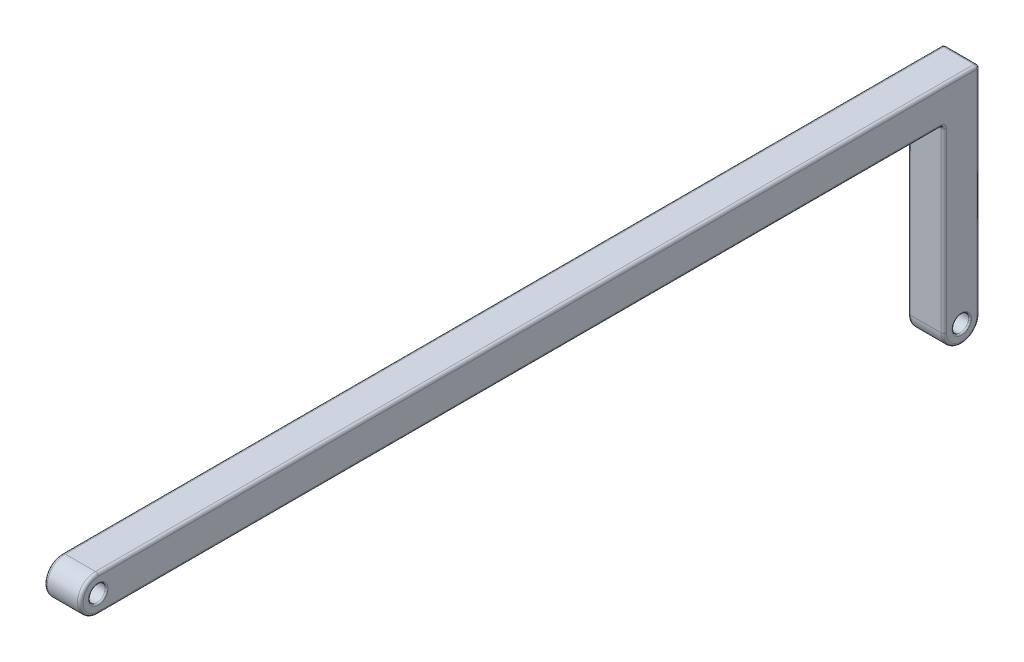
ISO-10303-21;
HEADER;
FILE_DESCRIPTION(('STEP AP214'),'2;1');
FILE_NAME('part.step','',(''),(''),'','','');
FILE_SCHEMA(('AUTOMOTIVE_DESIGN { 1 0 10303 214 1 1 1 1 }'));
ENDSEC;
DATA;
#1=APPLICATION_CONTEXT('core data for automotive mechanical design processes');
#2=APPLICATION_PROTOCOL_DEFINITION('international standard','automotive_design',2000,#1);
#3=PRODUCT_CONTEXT('',#1,'mechanical');
#4=PRODUCT('Part','Part','',(#3));
#5=PRODUCT_RELATED_PRODUCT_CATEGORY('part','',(#4));
#6=PRODUCT_DEFINITION_FORMATION('','',#4);
#7=PRODUCT_DEFINITION_CONTEXT('part definition',#1,'design');
#8=PRODUCT_DEFINITION('design','',#6,#7);
#9=PRODUCT_DEFINITION_SHAPE('','',#8);
#10=(LENGTH_UNIT() NAMED_UNIT(*) SI_UNIT(.MILLI.,.METRE.));
#11=(NAMED_UNIT(*) PLANE_ANGLE_UNIT() SI_UNIT($,.RADIAN.));
#12=(NAMED_UNIT(*) SI_UNIT($,.STERADIAN.) SOLID_ANGLE_UNIT());
#13=UNCERTAINTY_MEASURE_WITH_UNIT(LENGTH_MEASURE(1.E-05),#10,'distance_accuracy_value','');
#14=(GEOMETRIC_REPRESENTATION_CONTEXT(3) GLOBAL_UNCERTAINTY_ASSIGNED_CONTEXT((#13)) GLOBAL_UNIT_ASSIGNED_CONTEXT((#10,
#11,#12)) REPRESENTATION_CONTEXT('',''));
#15=CARTESIAN_POINT('',(0.,0.,0.));
#16=DIRECTION('',(0.,0.,1.));
#17=DIRECTION('',(1.,0.,0.));
#18=AXIS2_PLACEMENT_3D('',#15,#16,#17);
#19=CARTESIAN_POINT('',(2.5,-1.25,0.));
#20=DIRECTION('',(-1.,0.,0.));
#21=DIRECTION('',(0.,0.,1.));
#22=AXIS2_PLACEMENT_3D('',#19,#20,#21);
#23=PLANE('',#22);
#24=DIRECTION('',(0.,0.,1.));
#25=VECTOR('',#24,1.);
#26=CARTESIAN_POINT('',(2.5,-0.2,0.));
#27=LINE('',#26,#25);
#28=CARTESIAN_POINT('',(2.5,-0.2,-61.05));
#29=VERTEX_POINT('',#28);
#30=CARTESIAN_POINT('',(2.5,-0.2,0.));
#31=VERTEX_POINT('',#30);
#32=EDGE_CURVE('E304',#29,#31,#27,.T.);
#33=ORIENTED_EDGE('',*,*,#32,.T.);
#34=CARTESIAN_POINT('',(2.5,-1.25,0.));
#35=DIRECTION('',(-1.,0.,0.));
#36=DIRECTION('',(0.,0.,1.));
#37=AXIS2_PLACEMENT_3D('',#34,#35,#36);
#38=CIRCLE('',#37,1.05);
#39=CARTESIAN_POINT('',(2.5,-2.3,0.));
#40=VERTEX_POINT('',#39);
#41=EDGE_CURVE('E307',#31,#40,#38,.F.);
#42=ORIENTED_EDGE('',*,*,#41,.T.);
#43=DIRECTION('',(0.,0.,-1.));
#44=VECTOR('',#43,1.);
#45=CARTESIAN_POINT('',(2.5,-2.3,0.));
#46=LINE('',#45,#44);
#47=CARTESIAN_POINT('',(2.5,-2.3,-58.55));
#48=VERTEX_POINT('',#47);
#49=EDGE_CURVE('E157',#40,#48,#46,.T.);
#50=ORIENTED_EDGE('',*,*,#49,.T.);
#51=CARTESIAN_POINT('',(2.5,-2.7,-58.55));
#52=DIRECTION('',(-1.,0.,0.));
#53=DIRECTION('',(0.,0.,1.));
#54=AXIS2_PLACEMENT_3D('',#51,#52,#53);
#55=CIRCLE('',#54,0.4);
#56=CARTESIAN_POINT('',(2.5,-2.7,-58.95));
#57=VERTEX_POINT('',#56);
#58=EDGE_CURVE('E151',#57,#48,#55,.F.);
#59=ORIENTED_EDGE('',*,*,#58,.F.);
#60=DIRECTION('',(0.,-1.,0.));
#61=VECTOR('',#60,1.);
#62=CARTESIAN_POINT('',(2.5,-1.25,-58.95));
#63=LINE('',#62,#61);
#64=CARTESIAN_POINT('',(2.5,-15.,-58.95));
#65=VERTEX_POINT('',#64);
#66=EDGE_CURVE('E154',#57,#65,#63,.T.);
#67=ORIENTED_EDGE('',*,*,#66,.T.);
#68=CARTESIAN_POINT('',(2.5,-15.,-60.));
#69=DIRECTION('',(-1.,0.,0.));
#70=DIRECTION('',(0.,0.,1.));
#71=AXIS2_PLACEMENT_3D('',#68,#69,#70);
#72=CIRCLE('',#71,1.05);
#73=CARTESIAN_POINT('',(2.5,-15.,-61.05));
#74=VERTEX_POINT('',#73);
#75=EDGE_CURVE('E173',#65,#74,#72,.F.);
#76=ORIENTED_EDGE('',*,*,#75,.T.);
#77=DIRECTION('',(0.,1.,0.));
#78=VECTOR('',#77,1.);
#79=CARTESIAN_POINT('',(2.5,-1.25,-61.05));
#80=LINE('',#79,#78);
#81=EDGE_CURVE('E162',#74,#29,#80,.T.);
#82=ORIENTED_EDGE('',*,*,#81,.T.);
#83=EDGE_LOOP('',(#33,#42,#50,#59,#67,#76,#82));
#84=FACE_BOUND('',#83,.T.);
#85=CARTESIAN_POINT('',(2.5,-15.,-60.));
#86=DIRECTION('',(-1.,0.,0.));
#87=DIRECTION('',(0.,0.,1.));
#88=AXIS2_PLACEMENT_3D('',#85,#86,#87);
#89=CIRCLE('',#88,0.675000000000001);
#90=CARTESIAN_POINT('',(2.5,-15.,-59.325));
#91=VERTEX_POINT('',#90);
#92=EDGE_CURVE('E287',#91,#91,#89,.T.);
#93=ORIENTED_EDGE('',*,*,#92,.T.);
#94=EDGE_LOOP('',(#93));
#95=FACE_BOUND('',#94,.T.);
#96=CARTESIAN_POINT('',(2.5,-1.25,0.));
#97=DIRECTION('',(-1.,0.,0.));
#98=DIRECTION('',(0.,0.,1.));
#99=AXIS2_PLACEMENT_3D('',#96,#97,#98);
#100=CIRCLE('',#99,0.675);
#101=CARTESIAN_POINT('',(2.5,-1.25,0.675));
#102=VERTEX_POINT('',#101);
#103=EDGE_CURVE('E283',#102,#102,#100,.T.);
#104=ORIENTED_EDGE('',*,*,#103,.T.);
#105=EDGE_LOOP('',(#104));
#106=FACE_BOUND('',#105,.T.);
#107=ADVANCED_FACE('F45',(#84,#95,#106),#23,.F.);
#108=CARTESIAN_POINT('',(0.,-1.25,0.));
#109=DIRECTION('',(-1.,0.,0.));
#110=DIRECTION('',(0.,0.,1.));
#111=AXIS2_PLACEMENT_3D('',#108,#109,#110);
#112=PLANE('',#111);
#113=DIRECTION('',(0.,0.,-1.));
#114=VECTOR('',#113,1.);
#115=CARTESIAN_POINT('',(0.,-2.3,0.));
#116=LINE('',#115,#114);
#117=CARTESIAN_POINT('',(0.,-2.3,-58.55));
#118=VERTEX_POINT('',#117);
#119=CARTESIAN_POINT('',(0.,-2.3,0.));
#120=VERTEX_POINT('',#119);
#121=EDGE_CURVE('E339',#118,#120,#116,.F.);
#122=ORIENTED_EDGE('',*,*,#121,.T.);
#123=CARTESIAN_POINT('',(0.,-1.25,0.));
#124=DIRECTION('',(-1.,0.,0.));
#125=DIRECTION('',(0.,0.,1.));
#126=AXIS2_PLACEMENT_3D('',#123,#124,#125);
#127=CIRCLE('',#126,1.05);
#128=CARTESIAN_POINT('',(0.,-0.2,0.));
#129=VERTEX_POINT('',#128);
#130=EDGE_CURVE('E346',#120,#129,#127,.T.);
#131=ORIENTED_EDGE('',*,*,#130,.T.);
#132=DIRECTION('',(0.,0.,1.));
#133=VECTOR('',#132,1.);
#134=CARTESIAN_POINT('',(0.,-0.2,-61.25));
#135=LINE('',#134,#133);
#136=CARTESIAN_POINT('',(0.,-0.2,-61.05));
#137=VERTEX_POINT('',#136);
#138=EDGE_CURVE('E343',#129,#137,#135,.F.);
#139=ORIENTED_EDGE('',*,*,#138,.T.);
#140=DIRECTION('',(0.,1.,0.));
#141=VECTOR('',#140,1.);
#142=CARTESIAN_POINT('',(0.,-15.,-61.05));
#143=LINE('',#142,#141);
#144=CARTESIAN_POINT('',(0.,-15.,-61.05));
#145=VERTEX_POINT('',#144);
#146=EDGE_CURVE('E336',#137,#145,#143,.F.);
#147=ORIENTED_EDGE('',*,*,#146,.T.);
#148=CARTESIAN_POINT('',(0.,-15.,-60.));
#149=DIRECTION('',(-1.,0.,0.));
#150=DIRECTION('',(0.,0.,1.));
#151=AXIS2_PLACEMENT_3D('',#148,#149,#150);
#152=CIRCLE('',#151,1.05);
#153=CARTESIAN_POINT('',(0.,-15.,-58.95));
#154=VERTEX_POINT('',#153);
#155=EDGE_CURVE('E333',#145,#154,#152,.T.);
#156=ORIENTED_EDGE('',*,*,#155,.T.);
#157=DIRECTION('',(0.,-1.,0.));
#158=VECTOR('',#157,1.);
#159=CARTESIAN_POINT('',(0.,-2.5,-58.95));
#160=LINE('',#159,#158);
#161=CARTESIAN_POINT('',(0.,-2.7,-58.95));
#162=VERTEX_POINT('',#161);
#163=EDGE_CURVE('E330',#154,#162,#160,.F.);
#164=ORIENTED_EDGE('',*,*,#163,.T.);
#165=CARTESIAN_POINT('',(0.,-2.7,-58.55));
#166=DIRECTION('',(-1.,0.,0.));
#167=DIRECTION('',(0.,0.,1.));
#168=AXIS2_PLACEMENT_3D('',#165,#166,#167);
#169=CIRCLE('',#168,0.4);
#170=EDGE_CURVE('E326',#118,#162,#169,.T.);
#171=ORIENTED_EDGE('',*,*,#170,.F.);
#172=EDGE_LOOP('',(#122,#131,#139,#147,#156,#164,#171));
#173=FACE_BOUND('',#172,.T.);
#174=CARTESIAN_POINT('',(0.,-15.,-60.));
#175=DIRECTION('',(-1.,0.,0.));
#176=DIRECTION('',(0.,0.,1.));
#177=AXIS2_PLACEMENT_3D('',#174,#175,#176);
#178=CIRCLE('',#177,0.675000000000001);
#179=CARTESIAN_POINT('',(0.,-15.,-59.325));
#180=VERTEX_POINT('',#179);
#181=EDGE_CURVE('E271',#180,#180,#178,.F.);
#182=ORIENTED_EDGE('',*,*,#181,.T.);
#183=EDGE_LOOP('',(#182));
#184=FACE_BOUND('',#183,.T.);
#185=CARTESIAN_POINT('',(0.,-1.25,0.));
#186=DIRECTION('',(-1.,0.,0.));
#187=DIRECTION('',(0.,0.,1.));
#188=AXIS2_PLACEMENT_3D('',#185,#186,#187);
#189=CIRCLE('',#188,0.675);
#190=CARTESIAN_POINT('',(0.,-1.25,0.675));
#191=VERTEX_POINT('',#190);
#192=EDGE_CURVE('E267',#191,#191,#189,.F.);
#193=ORIENTED_EDGE('',*,*,#192,.T.);
#194=EDGE_LOOP('',(#193));
#195=FACE_BOUND('',#194,.T.);
#196=ADVANCED_FACE('F422',(#173,#184,#195),#112,.T.);
#197=CARTESIAN_POINT('',(2.5,-1.25,0.));
#198=DIRECTION('',(-1.,0.,0.));
#199=DIRECTION('',(0.,0.,1.));
#200=AXIS2_PLACEMENT_3D('',#197,#198,#199);
#201=CYLINDRICAL_SURFACE('',#200,1.25);
#202=DIRECTION('',(-1.,0.,0.));
#203=VECTOR('',#202,1.);
#204=CARTESIAN_POINT('',(2.5,-2.5,0.));
#205=LINE('',#204,#203);
#206=CARTESIAN_POINT('',(2.3,-2.5,0.));
#207=VERTEX_POINT('',#206);
#208=CARTESIAN_POINT('',(0.2,-2.5,0.));
#209=VERTEX_POINT('',#208);
#210=EDGE_CURVE('E263',#207,#209,#205,.T.);
#211=ORIENTED_EDGE('',*,*,#210,.F.);
#212=CARTESIAN_POINT('',(2.3,-1.25,0.));
#213=DIRECTION('',(-1.,0.,0.));
#214=DIRECTION('',(0.,0.,1.));
#215=AXIS2_PLACEMENT_3D('',#212,#213,#214);
#216=CIRCLE('',#215,1.25);
#217=CARTESIAN_POINT('',(2.3,0.,0.));
#218=VERTEX_POINT('',#217);
#219=EDGE_CURVE('E323',#207,#218,#216,.T.);
#220=ORIENTED_EDGE('',*,*,#219,.T.);
#221=DIRECTION('',(-1.,0.,0.));
#222=VECTOR('',#221,1.);
#223=CARTESIAN_POINT('',(2.5,0.,0.));
#224=LINE('',#223,#222);
#225=CARTESIAN_POINT('',(0.2,0.,0.));
#226=VERTEX_POINT('',#225);
#227=EDGE_CURVE('E246',#218,#226,#224,.T.);
#228=ORIENTED_EDGE('',*,*,#227,.T.);
#229=CARTESIAN_POINT('',(0.2,-1.25,0.));
#230=DIRECTION('',(-1.,0.,0.));
#231=DIRECTION('',(0.,0.,1.));
#232=AXIS2_PLACEMENT_3D('',#229,#230,#231);
#233=CIRCLE('',#232,1.25);
#234=EDGE_CURVE('E320',#226,#209,#233,.F.);
#235=ORIENTED_EDGE('',*,*,#234,.T.);
#236=EDGE_LOOP('',(#211,#220,#228,#235));
#237=FACE_BOUND('',#236,.T.);
#238=ADVANCED_FACE('F396',(#237),#201,.T.);
#239=CARTESIAN_POINT('',(2.5,-2.5,0.));
#240=DIRECTION('',(0.,1.,0.));
#241=DIRECTION('',(0.,0.,1.));
#242=AXIS2_PLACEMENT_3D('',#239,#240,#241);
#243=PLANE('',#242);
#244=DIRECTION('',(-1.,0.,0.));
#245=VECTOR('',#244,1.);
#246=CARTESIAN_POINT('',(2.5,-2.5,-58.55));
#247=LINE('',#246,#245);
#248=CARTESIAN_POINT('',(0.2,-2.5,-58.55));
#249=VERTEX_POINT('',#248);
#250=CARTESIAN_POINT('',(2.3,-2.5,-58.55));
#251=VERTEX_POINT('',#250);
#252=EDGE_CURVE('E310',#249,#251,#247,.F.);
#253=ORIENTED_EDGE('',*,*,#252,.T.);
#254=DIRECTION('',(0.,0.,-1.));
#255=VECTOR('',#254,1.);
#256=CARTESIAN_POINT('',(2.3,-2.5,0.));
#257=LINE('',#256,#255);
#258=EDGE_CURVE('E316',#251,#207,#257,.F.);
#259=ORIENTED_EDGE('',*,*,#258,.T.);
#260=ORIENTED_EDGE('',*,*,#210,.T.);
#261=DIRECTION('',(0.,0.,-1.));
#262=VECTOR('',#261,1.);
#263=CARTESIAN_POINT('',(0.2,-2.5,-58.75));
#264=LINE('',#263,#262);
#265=EDGE_CURVE('E313',#209,#249,#264,.T.);
#266=ORIENTED_EDGE('',*,*,#265,.T.);
#267=EDGE_LOOP('',(#253,#259,#260,#266));
#268=FACE_BOUND('',#267,.T.);
#269=ADVANCED_FACE('F393',(#268),#243,.F.);
#270=CARTESIAN_POINT('',(2.5,-15.,-58.75));
#271=DIRECTION('',(0.,0.,-1.));
#272=DIRECTION('',(-1.,0.,0.));
#273=AXIS2_PLACEMENT_3D('',#270,#271,#272);
#274=PLANE('',#273);
#275=DIRECTION('',(-1.,0.,0.));
#276=VECTOR('',#275,1.);
#277=CARTESIAN_POINT('',(2.5,-15.,-58.75));
#278=LINE('',#277,#276);
#279=CARTESIAN_POINT('',(2.3,-15.,-58.75));
#280=VERTEX_POINT('',#279);
#281=CARTESIAN_POINT('',(0.2,-15.,-58.75));
#282=VERTEX_POINT('',#281);
#283=EDGE_CURVE('E257',#280,#282,#278,.T.);
#284=ORIENTED_EDGE('',*,*,#283,.F.);
#285=DIRECTION('',(0.,-1.,0.));
#286=VECTOR('',#285,1.);
#287=CARTESIAN_POINT('',(2.3,-15.,-58.75));
#288=LINE('',#287,#286);
#289=CARTESIAN_POINT('',(2.3,-2.7,-58.75));
#290=VERTEX_POINT('',#289);
#291=EDGE_CURVE('E11',#280,#290,#288,.F.);
#292=ORIENTED_EDGE('',*,*,#291,.T.);
#293=DIRECTION('',(-1.,0.,0.));
#294=VECTOR('',#293,1.);
#295=CARTESIAN_POINT('',(0.,-2.7,-58.75));
#296=LINE('',#295,#294);
#297=CARTESIAN_POINT('',(0.2,-2.7,-58.75));
#298=VERTEX_POINT('',#297);
#299=EDGE_CURVE('E55',#290,#298,#296,.T.);
#300=ORIENTED_EDGE('',*,*,#299,.T.);
#301=DIRECTION('',(0.,-1.,0.));
#302=VECTOR('',#301,1.);
#303=CARTESIAN_POINT('',(0.2,-15.,-58.75));
#304=LINE('',#303,#302);
#305=EDGE_CURVE('E374',#298,#282,#304,.T.);
#306=ORIENTED_EDGE('',*,*,#305,.T.);
#307=EDGE_LOOP('',(#284,#292,#300,#306));
#308=FACE_BOUND('',#307,.T.);
#309=ADVANCED_FACE('F445',(#308),#274,.F.);
#310=CARTESIAN_POINT('',(2.5,-15.,-60.));
#311=DIRECTION('',(-1.,0.,0.));
#312=DIRECTION('',(0.,0.,1.));
#313=AXIS2_PLACEMENT_3D('',#310,#311,#312);
#314=CYLINDRICAL_SURFACE('',#313,1.25);
#315=DIRECTION('',(-1.,0.,0.));
#316=VECTOR('',#315,1.);
#317=CARTESIAN_POINT('',(2.5,-15.,-61.25));
#318=LINE('',#317,#316);
#319=CARTESIAN_POINT('',(2.3,-15.,-61.25));
#320=VERTEX_POINT('',#319);
#321=CARTESIAN_POINT('',(0.2,-15.,-61.25));
#322=VERTEX_POINT('',#321);
#323=EDGE_CURVE('E250',#320,#322,#318,.T.);
#324=ORIENTED_EDGE('',*,*,#323,.F.);
#325=CARTESIAN_POINT('',(2.3,-15.,-60.));
#326=DIRECTION('',(-1.,0.,0.));
#327=DIRECTION('',(0.,0.,1.));
#328=AXIS2_PLACEMENT_3D('',#325,#326,#327);
#329=CIRCLE('',#328,1.25);
#330=EDGE_CURVE('E362',#320,#280,#329,.T.);
#331=ORIENTED_EDGE('',*,*,#330,.T.);
#332=ORIENTED_EDGE('',*,*,#283,.T.);
#333=CARTESIAN_POINT('',(0.2,-15.,-60.));
#334=DIRECTION('',(-1.,0.,0.));
#335=DIRECTION('',(0.,0.,1.));
#336=AXIS2_PLACEMENT_3D('',#333,#334,#335);
#337=CIRCLE('',#336,1.25);
#338=EDGE_CURVE('E359',#282,#322,#337,.F.);
#339=ORIENTED_EDGE('',*,*,#338,.T.);
#340=EDGE_LOOP('',(#324,#331,#332,#339));
#341=FACE_BOUND('',#340,.T.);
#342=ADVANCED_FACE('F441',(#341),#314,.T.);
#343=CARTESIAN_POINT('',(2.5,0.,-61.25));
#344=DIRECTION('',(0.,0.,1.));
#345=DIRECTION('',(1.,0.,0.));
#346=AXIS2_PLACEMENT_3D('',#343,#344,#345);
#347=PLANE('',#346);
#348=DIRECTION('',(-1.,0.,0.));
#349=VECTOR('',#348,1.);
#350=CARTESIAN_POINT('',(2.5,-0.2,-61.25));
#351=LINE('',#350,#349);
#352=CARTESIAN_POINT('',(0.2,-0.2,-61.25));
#353=VERTEX_POINT('',#352);
#354=CARTESIAN_POINT('',(2.3,-0.2,-61.25));
#355=VERTEX_POINT('',#354);
#356=EDGE_CURVE('E349',#353,#355,#351,.F.);
#357=ORIENTED_EDGE('',*,*,#356,.T.);
#358=DIRECTION('',(0.,1.,0.));
#359=VECTOR('',#358,1.);
#360=CARTESIAN_POINT('',(2.3,0.,-61.25));
#361=LINE('',#360,#359);
#362=EDGE_CURVE('E355',#355,#320,#361,.F.);
#363=ORIENTED_EDGE('',*,*,#362,.T.);
#364=ORIENTED_EDGE('',*,*,#323,.T.);
#365=DIRECTION('',(0.,1.,0.));
#366=VECTOR('',#365,1.);
#367=CARTESIAN_POINT('',(0.2,0.,-61.25));
#368=LINE('',#367,#366);
#369=EDGE_CURVE('E352',#322,#353,#368,.T.);
#370=ORIENTED_EDGE('',*,*,#369,.T.);
#371=EDGE_LOOP('',(#357,#363,#364,#370));
#372=FACE_BOUND('',#371,.T.);
#373=ADVANCED_FACE('F437',(#372),#347,.F.);
#374=CARTESIAN_POINT('',(2.5,0.,0.));
#375=DIRECTION('',(0.,-1.,0.));
#376=DIRECTION('',(0.,0.,-1.));
#377=AXIS2_PLACEMENT_3D('',#374,#375,#376);
#378=PLANE('',#377);
#379=ORIENTED_EDGE('',*,*,#227,.F.);
#380=DIRECTION('',(0.,0.,1.));
#381=VECTOR('',#380,1.);
#382=CARTESIAN_POINT('',(2.3,0.,0.));
#383=LINE('',#382,#381);
#384=CARTESIAN_POINT('',(2.3,0.,-61.05));
#385=VERTEX_POINT('',#384);
#386=EDGE_CURVE('E371',#218,#385,#383,.F.);
#387=ORIENTED_EDGE('',*,*,#386,.T.);
#388=DIRECTION('',(-1.,0.,0.));
#389=VECTOR('',#388,1.);
#390=CARTESIAN_POINT('',(2.5,0.,-61.05));
#391=LINE('',#390,#389);
#392=CARTESIAN_POINT('',(0.2,0.,-61.05));
#393=VERTEX_POINT('',#392);
#394=EDGE_CURVE('E368',#385,#393,#391,.T.);
#395=ORIENTED_EDGE('',*,*,#394,.T.);
#396=DIRECTION('',(0.,0.,1.));
#397=VECTOR('',#396,1.);
#398=CARTESIAN_POINT('',(0.2,0.,0.));
#399=LINE('',#398,#397);
#400=EDGE_CURVE('E365',#393,#226,#399,.T.);
#401=ORIENTED_EDGE('',*,*,#400,.T.);
#402=EDGE_LOOP('',(#379,#387,#395,#401));
#403=FACE_BOUND('',#402,.T.);
#404=ADVANCED_FACE('F434',(#403),#378,.F.);
#405=CARTESIAN_POINT('',(2.5,-1.25,0.));
#406=DIRECTION('',(-1.,0.,0.));
#407=DIRECTION('',(0.,0.,1.));
#408=AXIS2_PLACEMENT_3D('',#405,#406,#407);
#409=CYLINDRICAL_SURFACE('',#408,0.575);
#410=CARTESIAN_POINT('',(0.0999999999999998,-1.25,0.));
#411=DIRECTION('',(-1.,0.,0.));
#412=DIRECTION('',(0.,0.,1.));
#413=AXIS2_PLACEMENT_3D('',#410,#411,#412);
#414=CIRCLE('',#413,0.575);
#415=CARTESIAN_POINT('',(0.0999999999999998,-1.25,0.575));
#416=VERTEX_POINT('',#415);
#417=EDGE_CURVE('E174',#416,#416,#414,.T.);
#418=ORIENTED_EDGE('',*,*,#417,.T.);
#419=EDGE_LOOP('',(#418));
#420=FACE_BOUND('',#419,.T.);
#421=CARTESIAN_POINT('',(2.4,-1.25,0.));
#422=DIRECTION('',(-1.,0.,0.));
#423=DIRECTION('',(0.,0.,1.));
#424=AXIS2_PLACEMENT_3D('',#421,#422,#423);
#425=CIRCLE('',#424,0.575);
#426=CARTESIAN_POINT('',(2.4,-1.25,0.575));
#427=VERTEX_POINT('',#426);
#428=EDGE_CURVE('E291',#427,#427,#425,.F.);
#429=ORIENTED_EDGE('',*,*,#428,.T.);
#430=EDGE_LOOP('',(#429));
#431=FACE_BOUND('',#430,.T.);
#432=ADVANCED_FACE('F431',(#420,#431),#409,.F.);
#433=CARTESIAN_POINT('',(2.5,-15.,-60.));
#434=DIRECTION('',(-1.,0.,0.));
#435=DIRECTION('',(0.,0.,1.));
#436=AXIS2_PLACEMENT_3D('',#433,#434,#435);
#437=CYLINDRICAL_SURFACE('',#436,0.575000000000001);
#438=CARTESIAN_POINT('',(0.0999999999999998,-15.,-60.));
#439=DIRECTION('',(-1.,0.,0.));
#440=DIRECTION('',(0.,0.,1.));
#441=AXIS2_PLACEMENT_3D('',#438,#439,#440);
#442=CIRCLE('',#441,0.575000000000001);
#443=CARTESIAN_POINT('',(0.0999999999999998,-15.,-59.425));
#444=VERTEX_POINT('',#443);
#445=EDGE_CURVE('E279',#444,#444,#442,.T.);
#446=ORIENTED_EDGE('',*,*,#445,.T.);
#447=EDGE_LOOP('',(#446));
#448=FACE_BOUND('',#447,.T.);
#449=CARTESIAN_POINT('',(2.4,-15.,-60.));
#450=DIRECTION('',(-1.,0.,0.));
#451=DIRECTION('',(0.,0.,1.));
#452=AXIS2_PLACEMENT_3D('',#449,#450,#451);
#453=CIRCLE('',#452,0.575000000000001);
#454=CARTESIAN_POINT('',(2.4,-15.,-59.425));
#455=VERTEX_POINT('',#454);
#456=EDGE_CURVE('E275',#455,#455,#453,.F.);
#457=ORIENTED_EDGE('',*,*,#456,.T.);
#458=EDGE_LOOP('',(#457));
#459=FACE_BOUND('',#458,.T.);
#460=ADVANCED_FACE('F457',(#448,#459),#437,.F.);
#461=CARTESIAN_POINT('',(0.0999999999999998,-15.,-60.));
#462=DIRECTION('',(-1.,0.,0.));
#463=DIRECTION('',(0.,0.,1.));
#464=AXIS2_PLACEMENT_3D('',#461,#462,#463);
#465=TOROIDAL_SURFACE('',#464,0.675000000000001,0.1);
#466=ORIENTED_EDGE('',*,*,#445,.F.);
#467=EDGE_LOOP('',(#466));
#468=FACE_BOUND('',#467,.T.);
#469=ORIENTED_EDGE('',*,*,#181,.F.);
#470=EDGE_LOOP('',(#469));
#471=FACE_BOUND('',#470,.T.);
#472=ADVANCED_FACE('F453',(#468,#471),#465,.T.);
#473=CARTESIAN_POINT('',(2.4,-15.,-60.));
#474=DIRECTION('',(-1.,0.,0.));
#475=DIRECTION('',(0.,0.,1.));
#476=AXIS2_PLACEMENT_3D('',#473,#474,#475);
#477=TOROIDAL_SURFACE('',#476,0.675000000000001,0.1);
#478=ORIENTED_EDGE('',*,*,#92,.F.);
#479=EDGE_LOOP('',(#478));
#480=FACE_BOUND('',#479,.T.);
#481=ORIENTED_EDGE('',*,*,#456,.F.);
#482=EDGE_LOOP('',(#481));
#483=FACE_BOUND('',#482,.T.);
#484=ADVANCED_FACE('F456',(#480,#483),#477,.T.);
#485=CARTESIAN_POINT('',(0.0999999999999998,-1.25,0.));
#486=DIRECTION('',(-1.,0.,0.));
#487=DIRECTION('',(0.,0.,1.));
#488=AXIS2_PLACEMENT_3D('',#485,#486,#487);
#489=TOROIDAL_SURFACE('',#488,0.675,0.1);
#490=ORIENTED_EDGE('',*,*,#417,.F.);
#491=EDGE_LOOP('',(#490));
#492=FACE_BOUND('',#491,.T.);
#493=ORIENTED_EDGE('',*,*,#192,.F.);
#494=EDGE_LOOP('',(#493));
#495=FACE_BOUND('',#494,.T.);
#496=ADVANCED_FACE('F461',(#492,#495),#489,.T.);
#497=CARTESIAN_POINT('',(2.4,-1.25,0.));
#498=DIRECTION('',(-1.,0.,0.));
#499=DIRECTION('',(0.,0.,1.));
#500=AXIS2_PLACEMENT_3D('',#497,#498,#499);
#501=TOROIDAL_SURFACE('',#500,0.675,0.1);
#502=ORIENTED_EDGE('',*,*,#103,.F.);
#503=EDGE_LOOP('',(#502));
#504=FACE_BOUND('',#503,.T.);
#505=ORIENTED_EDGE('',*,*,#428,.F.);
#506=EDGE_LOOP('',(#505));
#507=FACE_BOUND('',#506,.T.);
#508=ADVANCED_FACE('F465',(#504,#507),#501,.T.);
#509=CARTESIAN_POINT('',(0.2,0.,-61.05));
#510=DIRECTION('',(0.,-1.,0.));
#511=DIRECTION('',(0.,0.,-1.));
#512=AXIS2_PLACEMENT_3D('',#509,#510,#511);
#513=CYLINDRICAL_SURFACE('',#512,0.2);
#514=CARTESIAN_POINT('',(0.2,-15.,-61.05));
#515=DIRECTION('',(0.,-1.,0.));
#516=DIRECTION('',(0.,0.,-1.));
#517=AXIS2_PLACEMENT_3D('',#514,#515,#516);
#518=CIRCLE('',#517,0.2);
#519=EDGE_CURVE('E235',#145,#322,#518,.T.);
#520=ORIENTED_EDGE('',*,*,#519,.F.);
#521=ORIENTED_EDGE('',*,*,#146,.F.);
#522=CARTESIAN_POINT('',(0.2,-0.2,-61.05));
#523=DIRECTION('',(0.,1.,0.));
#524=DIRECTION('',(0.,0.,1.));
#525=AXIS2_PLACEMENT_3D('',#522,#523,#524);
#526=CIRCLE('',#525,0.2);
#527=EDGE_CURVE('E238',#353,#137,#526,.T.);
#528=ORIENTED_EDGE('',*,*,#527,.F.);
#529=ORIENTED_EDGE('',*,*,#369,.F.);
#530=EDGE_LOOP('',(#520,#521,#528,#529));
#531=FACE_BOUND('',#530,.T.);
#532=ADVANCED_FACE('F47',(#531),#513,.T.);
#533=CARTESIAN_POINT('',(0.2,-0.2,0.));
#534=DIRECTION('',(0.,0.,-1.));
#535=DIRECTION('',(-1.,0.,0.));
#536=AXIS2_PLACEMENT_3D('',#533,#534,#535);
#537=CYLINDRICAL_SURFACE('',#536,0.2);
#538=CARTESIAN_POINT('',(0.2,-0.2,-61.05));
#539=DIRECTION('',(0.,0.,-1.));
#540=DIRECTION('',(-1.,0.,0.));
#541=AXIS2_PLACEMENT_3D('',#538,#539,#540);
#542=CIRCLE('',#541,0.2);
#543=EDGE_CURVE('E49',#137,#393,#542,.T.);
#544=ORIENTED_EDGE('',*,*,#543,.F.);
#545=ORIENTED_EDGE('',*,*,#138,.F.);
#546=CARTESIAN_POINT('',(0.2,-0.2,0.));
#547=DIRECTION('',(0.,0.,1.));
#548=DIRECTION('',(1.,0.,0.));
#549=AXIS2_PLACEMENT_3D('',#546,#547,#548);
#550=CIRCLE('',#549,0.2);
#551=EDGE_CURVE('E231',#226,#129,#550,.T.);
#552=ORIENTED_EDGE('',*,*,#551,.F.);
#553=ORIENTED_EDGE('',*,*,#400,.F.);
#554=EDGE_LOOP('',(#544,#545,#552,#553));
#555=FACE_BOUND('',#554,.T.);
#556=ADVANCED_FACE('F588',(#555),#537,.T.);
#557=CARTESIAN_POINT('',(0.2,-0.2,-61.05));
#558=DIRECTION('',(-1.,0.,0.));
#559=DIRECTION('',(0.,0.,1.));
#560=AXIS2_PLACEMENT_3D('',#557,#558,#559);
#561=SPHERICAL_SURFACE('',#560,0.2);
#562=ORIENTED_EDGE('',*,*,#527,.T.);
#563=ORIENTED_EDGE('',*,*,#543,.T.);
#564=CARTESIAN_POINT('',(0.2,-0.2,-61.05));
#565=DIRECTION('',(-1.,0.,0.));
#566=DIRECTION('',(0.,0.,1.));
#567=AXIS2_PLACEMENT_3D('',#564,#565,#566);
#568=CIRCLE('',#567,0.2);
#569=EDGE_CURVE('E227',#353,#393,#568,.F.);
#570=ORIENTED_EDGE('',*,*,#569,.F.);
#571=EDGE_LOOP('',(#562,#563,#570));
#572=FACE_BOUND('',#571,.T.);
#573=ADVANCED_FACE('F579',(#572),#561,.T.);
#574=CARTESIAN_POINT('',(0.2,-15.,-60.));
#575=DIRECTION('',(-1.,0.,0.));
#576=DIRECTION('',(0.,0.,1.));
#577=AXIS2_PLACEMENT_3D('',#574,#575,#576);
#578=TOROIDAL_SURFACE('',#577,1.05,0.2);
#579=ORIENTED_EDGE('',*,*,#519,.T.);
#580=ORIENTED_EDGE('',*,*,#338,.F.);
#581=CARTESIAN_POINT('',(0.2,-15.,-58.95));
#582=DIRECTION('',(0.,1.,0.));
#583=DIRECTION('',(0.,0.,1.));
#584=AXIS2_PLACEMENT_3D('',#581,#582,#583);
#585=CIRCLE('',#584,0.2);
#586=EDGE_CURVE('E223',#154,#282,#585,.T.);
#587=ORIENTED_EDGE('',*,*,#586,.F.);
#588=ORIENTED_EDGE('',*,*,#155,.F.);
#589=EDGE_LOOP('',(#579,#580,#587,#588));
#590=FACE_BOUND('',#589,.T.);
#591=ADVANCED_FACE('F571',(#590),#578,.T.);
#592=CARTESIAN_POINT('',(0.2,-1.25,0.));
#593=DIRECTION('',(-1.,0.,0.));
#594=DIRECTION('',(0.,0.,1.));
#595=AXIS2_PLACEMENT_3D('',#592,#593,#594);
#596=TOROIDAL_SURFACE('',#595,1.05,0.2);
#597=ORIENTED_EDGE('',*,*,#551,.T.);
#598=ORIENTED_EDGE('',*,*,#130,.F.);
#599=CARTESIAN_POINT('',(0.2,-2.3,0.));
#600=DIRECTION('',(0.,0.,-1.));
#601=DIRECTION('',(-1.,0.,0.));
#602=AXIS2_PLACEMENT_3D('',#599,#600,#601);
#603=CIRCLE('',#602,0.2);
#604=EDGE_CURVE('E220',#209,#120,#603,.T.);
#605=ORIENTED_EDGE('',*,*,#604,.F.);
#606=ORIENTED_EDGE('',*,*,#234,.F.);
#607=EDGE_LOOP('',(#597,#598,#605,#606));
#608=FACE_BOUND('',#607,.T.);
#609=ADVANCED_FACE('F399',(#608),#596,.T.);
#610=CARTESIAN_POINT('',(2.5,-0.2,-61.05));
#611=DIRECTION('',(-1.,0.,0.));
#612=DIRECTION('',(0.,0.,1.));
#613=AXIS2_PLACEMENT_3D('',#610,#611,#612);
#614=CYLINDRICAL_SURFACE('',#613,0.2);
#615=ORIENTED_EDGE('',*,*,#569,.T.);
#616=ORIENTED_EDGE('',*,*,#394,.F.);
#617=CARTESIAN_POINT('',(2.3,-0.2,-61.05));
#618=DIRECTION('',(1.,0.,0.));
#619=DIRECTION('',(0.,0.,-1.));
#620=AXIS2_PLACEMENT_3D('',#617,#618,#619);
#621=CIRCLE('',#620,0.2);
#622=EDGE_CURVE('E216',#355,#385,#621,.T.);
#623=ORIENTED_EDGE('',*,*,#622,.F.);
#624=ORIENTED_EDGE('',*,*,#356,.F.);
#625=EDGE_LOOP('',(#615,#616,#623,#624));
#626=FACE_BOUND('',#625,.T.);
#627=ADVANCED_FACE('F554',(#626),#614,.T.);
#628=CARTESIAN_POINT('',(2.3,-1.25,-61.05));
#629=DIRECTION('',(0.,1.,0.));
#630=DIRECTION('',(0.,0.,1.));
#631=AXIS2_PLACEMENT_3D('',#628,#629,#630);
#632=CYLINDRICAL_SURFACE('',#631,0.2);
#633=CARTESIAN_POINT('',(2.3,-15.,-61.05));
#634=DIRECTION('',(0.,-1.,0.));
#635=DIRECTION('',(0.,0.,-1.));
#636=AXIS2_PLACEMENT_3D('',#633,#634,#635);
#637=CIRCLE('',#636,0.2);
#638=EDGE_CURVE('E208',#320,#74,#637,.T.);
#639=ORIENTED_EDGE('',*,*,#638,.F.);
#640=ORIENTED_EDGE('',*,*,#362,.F.);
#641=CARTESIAN_POINT('',(2.3,-0.2,-61.05));
#642=DIRECTION('',(0.,1.,0.));
#643=DIRECTION('',(0.,0.,1.));
#644=AXIS2_PLACEMENT_3D('',#641,#642,#643);
#645=CIRCLE('',#644,0.2);
#646=EDGE_CURVE('E212',#29,#355,#645,.T.);
#647=ORIENTED_EDGE('',*,*,#646,.F.);
#648=ORIENTED_EDGE('',*,*,#81,.F.);
#649=EDGE_LOOP('',(#639,#640,#647,#648));
#650=FACE_BOUND('',#649,.T.);
#651=ADVANCED_FACE('F545',(#650),#632,.T.);
#652=CARTESIAN_POINT('',(0.2,-15.,-58.95));
#653=DIRECTION('',(0.,1.,0.));
#654=DIRECTION('',(0.,0.,1.));
#655=AXIS2_PLACEMENT_3D('',#652,#653,#654);
#656=CYLINDRICAL_SURFACE('',#655,0.2);
#657=ORIENTED_EDGE('',*,*,#586,.T.);
#658=ORIENTED_EDGE('',*,*,#305,.F.);
#659=CARTESIAN_POINT('',(0.2,-2.7,-58.95));
#660=DIRECTION('',(0.,1.,0.));
#661=DIRECTION('',(0.,0.,1.));
#662=AXIS2_PLACEMENT_3D('',#659,#660,#661);
#663=CIRCLE('',#662,0.2);
#664=EDGE_CURVE('E204',#162,#298,#663,.T.);
#665=ORIENTED_EDGE('',*,*,#664,.F.);
#666=ORIENTED_EDGE('',*,*,#163,.F.);
#667=EDGE_LOOP('',(#657,#658,#665,#666));
#668=FACE_BOUND('',#667,.T.);
#669=ADVANCED_FACE('F537',(#668),#656,.T.);
#670=CARTESIAN_POINT('',(0.2,-2.3,0.));
#671=DIRECTION('',(0.,0.,1.));
#672=DIRECTION('',(0.,-1.,0.));
#673=AXIS2_PLACEMENT_3D('',#670,#671,#672);
#674=CYLINDRICAL_SURFACE('',#673,0.2);
#675=ORIENTED_EDGE('',*,*,#604,.T.);
#676=ORIENTED_EDGE('',*,*,#121,.F.);
#677=CARTESIAN_POINT('',(0.2,-2.3,-58.55));
#678=DIRECTION('',(0.,0.,-1.));
#679=DIRECTION('',(-1.,0.,0.));
#680=AXIS2_PLACEMENT_3D('',#677,#678,#679);
#681=CIRCLE('',#680,0.2);
#682=EDGE_CURVE('E200',#249,#118,#681,.T.);
#683=ORIENTED_EDGE('',*,*,#682,.F.);
#684=ORIENTED_EDGE('',*,*,#265,.F.);
#685=EDGE_LOOP('',(#675,#676,#683,#684));
#686=FACE_BOUND('',#685,.T.);
#687=ADVANCED_FACE('F405',(#686),#674,.T.);
#688=CARTESIAN_POINT('',(2.3,-0.2,-61.05));
#689=DIRECTION('',(0.,0.,-1.));
#690=DIRECTION('',(-1.,0.,0.));
#691=AXIS2_PLACEMENT_3D('',#688,#689,#690);
#692=SPHERICAL_SURFACE('',#691,0.2);
#693=ORIENTED_EDGE('',*,*,#646,.T.);
#694=ORIENTED_EDGE('',*,*,#622,.T.);
#695=CARTESIAN_POINT('',(2.3,-0.2,-61.05));
#696=DIRECTION('',(0.,0.,-1.));
#697=DIRECTION('',(-1.,0.,0.));
#698=AXIS2_PLACEMENT_3D('',#695,#696,#697);
#699=CIRCLE('',#698,0.2);
#700=EDGE_CURVE('E196',#29,#385,#699,.F.);
#701=ORIENTED_EDGE('',*,*,#700,.F.);
#702=EDGE_LOOP('',(#693,#694,#701));
#703=FACE_BOUND('',#702,.T.);
#704=ADVANCED_FACE('F520',(#703),#692,.T.);
#705=CARTESIAN_POINT('',(2.3,-15.,-60.));
#706=DIRECTION('',(-1.,0.,0.));
#707=DIRECTION('',(0.,0.,1.));
#708=AXIS2_PLACEMENT_3D('',#705,#706,#707);
#709=TOROIDAL_SURFACE('',#708,1.05,0.2);
#710=ORIENTED_EDGE('',*,*,#638,.T.);
#711=ORIENTED_EDGE('',*,*,#75,.F.);
#712=CARTESIAN_POINT('',(2.3,-15.,-58.95));
#713=DIRECTION('',(0.,1.,0.));
#714=DIRECTION('',(0.,0.,1.));
#715=AXIS2_PLACEMENT_3D('',#712,#713,#714);
#716=CIRCLE('',#715,0.2);
#717=EDGE_CURVE('E171',#280,#65,#716,.T.);
#718=ORIENTED_EDGE('',*,*,#717,.F.);
#719=ORIENTED_EDGE('',*,*,#330,.F.);
#720=EDGE_LOOP('',(#710,#711,#718,#719));
#721=FACE_BOUND('',#720,.T.);
#722=ADVANCED_FACE('F512',(#721),#709,.T.);
#723=CARTESIAN_POINT('',(0.2,-2.7,-58.55));
#724=DIRECTION('',(-1.,0.,0.));
#725=DIRECTION('',(0.,0.,1.));
#726=AXIS2_PLACEMENT_3D('',#723,#724,#725);
#727=TOROIDAL_SURFACE('',#726,0.4,0.2);
#728=ORIENTED_EDGE('',*,*,#170,.T.);
#729=ORIENTED_EDGE('',*,*,#664,.T.);
#730=CARTESIAN_POINT('',(0.2,-2.7,-58.55));
#731=DIRECTION('',(-1.,0.,0.));
#732=DIRECTION('',(0.,0.,1.));
#733=AXIS2_PLACEMENT_3D('',#730,#731,#732);
#734=CIRCLE('',#733,0.2);
#735=EDGE_CURVE('E185',#249,#298,#734,.T.);
#736=ORIENTED_EDGE('',*,*,#735,.F.);
#737=ORIENTED_EDGE('',*,*,#682,.T.);
#738=EDGE_LOOP('',(#728,#729,#736,#737));
#739=FACE_BOUND('',#738,.T.);
#740=ADVANCED_FACE('F408',(#739),#727,.T.);
#741=CARTESIAN_POINT('',(2.3,-0.2,0.));
#742=DIRECTION('',(0.,0.,1.));
#743=DIRECTION('',(1.,0.,0.));
#744=AXIS2_PLACEMENT_3D('',#741,#742,#743);
#745=CYLINDRICAL_SURFACE('',#744,0.2);
#746=ORIENTED_EDGE('',*,*,#700,.T.);
#747=ORIENTED_EDGE('',*,*,#386,.F.);
#748=CARTESIAN_POINT('',(2.3,-0.2,0.));
#749=DIRECTION('',(0.,0.,1.));
#750=DIRECTION('',(0.,-1.,0.));
#751=AXIS2_PLACEMENT_3D('',#748,#749,#750);
#752=CIRCLE('',#751,0.2);
#753=EDGE_CURVE('E180',#31,#218,#752,.T.);
#754=ORIENTED_EDGE('',*,*,#753,.F.);
#755=ORIENTED_EDGE('',*,*,#32,.F.);
#756=EDGE_LOOP('',(#746,#747,#754,#755));
#757=FACE_BOUND('',#756,.T.);
#758=ADVANCED_FACE('F419',(#757),#745,.T.);
#759=CARTESIAN_POINT('',(2.3,-1.25,-58.95));
#760=DIRECTION('',(0.,-1.,0.));
#761=DIRECTION('',(0.,0.,-1.));
#762=AXIS2_PLACEMENT_3D('',#759,#760,#761);
#763=CYLINDRICAL_SURFACE('',#762,0.2);
#764=ORIENTED_EDGE('',*,*,#717,.T.);
#765=ORIENTED_EDGE('',*,*,#66,.F.);
#766=CARTESIAN_POINT('',(2.3,-2.7,-58.95));
#767=DIRECTION('',(0.,1.,0.));
#768=DIRECTION('',(0.,0.,1.));
#769=AXIS2_PLACEMENT_3D('',#766,#767,#768);
#770=CIRCLE('',#769,0.2);
#771=EDGE_CURVE('E168',#290,#57,#770,.T.);
#772=ORIENTED_EDGE('',*,*,#771,.F.);
#773=ORIENTED_EDGE('',*,*,#291,.F.);
#774=EDGE_LOOP('',(#764,#765,#772,#773));
#775=FACE_BOUND('',#774,.T.);
#776=ADVANCED_FACE('F167',(#775),#763,.T.);
#777=CARTESIAN_POINT('',(2.5,-2.7,-58.55));
#778=DIRECTION('',(1.,0.,0.));
#779=DIRECTION('',(0.,0.,-1.));
#780=AXIS2_PLACEMENT_3D('',#777,#778,#779);
#781=CYLINDRICAL_SURFACE('',#780,0.2);
#782=ORIENTED_EDGE('',*,*,#735,.T.);
#783=ORIENTED_EDGE('',*,*,#299,.F.);
#784=CARTESIAN_POINT('',(2.3,-2.7,-58.55));
#785=DIRECTION('',(-1.,0.,0.));
#786=DIRECTION('',(0.,0.,1.));
#787=AXIS2_PLACEMENT_3D('',#784,#785,#786);
#788=CIRCLE('',#787,0.2);
#789=EDGE_CURVE('E178',#251,#290,#788,.T.);
#790=ORIENTED_EDGE('',*,*,#789,.F.);
#791=ORIENTED_EDGE('',*,*,#252,.F.);
#792=EDGE_LOOP('',(#782,#783,#790,#791));
#793=FACE_BOUND('',#792,.T.);
#794=ADVANCED_FACE('F411',(#793),#781,.F.);
#795=CARTESIAN_POINT('',(2.3,-1.25,0.));
#796=DIRECTION('',(-1.,0.,0.));
#797=DIRECTION('',(0.,0.,1.));
#798=AXIS2_PLACEMENT_3D('',#795,#796,#797);
#799=TOROIDAL_SURFACE('',#798,1.05,0.2);
#800=ORIENTED_EDGE('',*,*,#753,.T.);
#801=ORIENTED_EDGE('',*,*,#219,.F.);
#802=CARTESIAN_POINT('',(2.3,-2.3,0.));
#803=DIRECTION('',(0.,0.,-1.));
#804=DIRECTION('',(0.,1.,0.));
#805=AXIS2_PLACEMENT_3D('',#802,#803,#804);
#806=CIRCLE('',#805,0.2);
#807=EDGE_CURVE('E187',#40,#207,#806,.T.);
#808=ORIENTED_EDGE('',*,*,#807,.F.);
#809=ORIENTED_EDGE('',*,*,#41,.F.);
#810=EDGE_LOOP('',(#800,#801,#808,#809));
#811=FACE_BOUND('',#810,.T.);
#812=ADVANCED_FACE('F389',(#811),#799,.T.);
#813=CARTESIAN_POINT('',(2.3,-2.7,-58.55));
#814=DIRECTION('',(-1.,0.,0.));
#815=DIRECTION('',(0.,0.,1.));
#816=AXIS2_PLACEMENT_3D('',#813,#814,#815);
#817=TOROIDAL_SURFACE('',#816,0.4,0.2);
#818=ORIENTED_EDGE('',*,*,#771,.T.);
#819=ORIENTED_EDGE('',*,*,#58,.T.);
#820=CARTESIAN_POINT('',(2.3,-2.3,-58.55));
#821=DIRECTION('',(0.,0.,-1.));
#822=DIRECTION('',(-1.,0.,0.));
#823=AXIS2_PLACEMENT_3D('',#820,#821,#822);
#824=CIRCLE('',#823,0.2);
#825=EDGE_CURVE('E379',#251,#48,#824,.F.);
#826=ORIENTED_EDGE('',*,*,#825,.F.);
#827=ORIENTED_EDGE('',*,*,#789,.T.);
#828=EDGE_LOOP('',(#818,#819,#826,#827));
#829=FACE_BOUND('',#828,.T.);
#830=ADVANCED_FACE('F176',(#829),#817,.T.);
#831=CARTESIAN_POINT('',(2.3,-2.3,0.));
#832=DIRECTION('',(0.,0.,-1.));
#833=DIRECTION('',(0.,1.,0.));
#834=AXIS2_PLACEMENT_3D('',#831,#832,#833);
#835=CYLINDRICAL_SURFACE('',#834,0.2);
#836=ORIENTED_EDGE('',*,*,#807,.T.);
#837=ORIENTED_EDGE('',*,*,#258,.F.);
#838=ORIENTED_EDGE('',*,*,#825,.T.);
#839=ORIENTED_EDGE('',*,*,#49,.F.);
#840=EDGE_LOOP('',(#836,#837,#838,#839));
#841=FACE_BOUND('',#840,.T.);
#842=ADVANCED_FACE('F386',(#841),#835,.T.);
#843=CLOSED_SHELL('',(#107,#196,#238,#269,#309,#342,#373,#404,#432,#460,#472,#484,#496,#508,
#532,#556,#573,#591,#609,#627,#651,#669,#687,#704,#722,#740,#758,#776,#794,#812,#830,#842));
#844=MANIFOLD_SOLID_BREP('B2',#843);
#845=ADVANCED_BREP_SHAPE_REPRESENTATION('',(#18,#844),#14);
#846=SHAPE_DEFINITION_REPRESENTATION(#9,#845);
ENDSEC;
END-ISO-10303-21;
